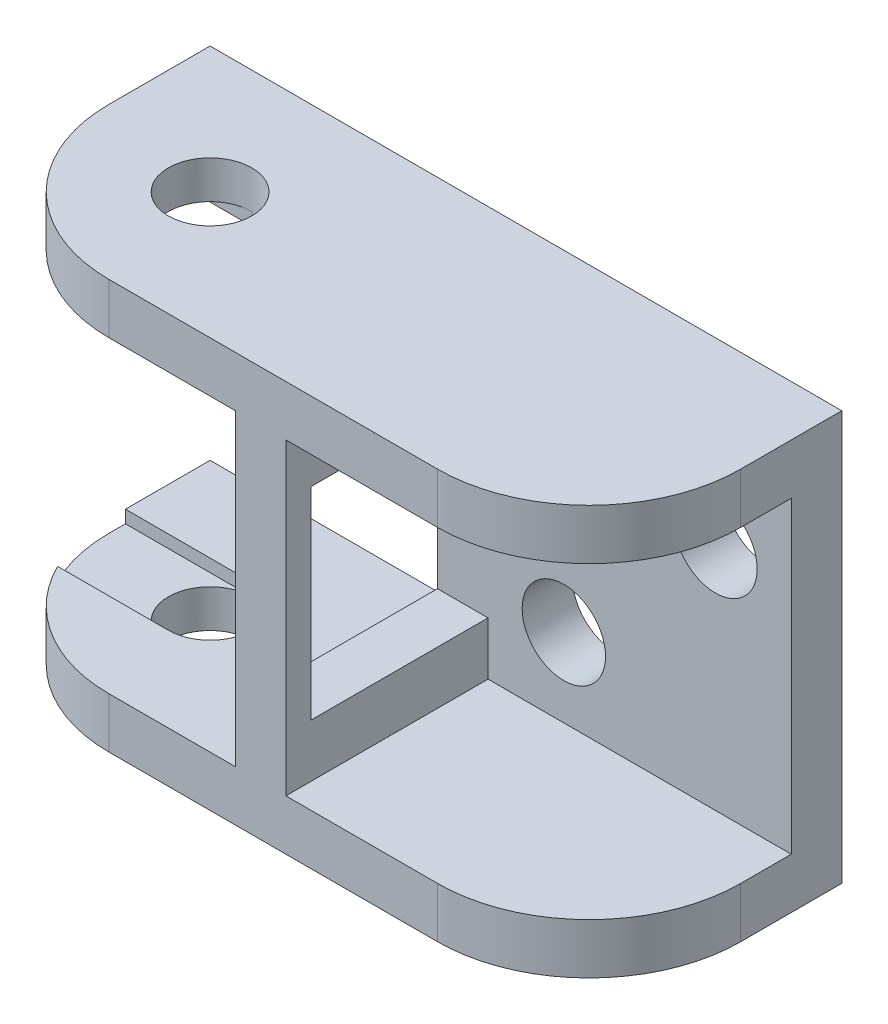
ISO-10303-21;
HEADER;
FILE_DESCRIPTION(('STEP AP214'),'2;1');
FILE_NAME('part.step','',(''),(''),'','','');
FILE_SCHEMA(('AUTOMOTIVE_DESIGN { 1 0 10303 214 1 1 1 1 }'));
ENDSEC;
DATA;
#1=APPLICATION_CONTEXT('core data for automotive mechanical design processes');
#2=APPLICATION_PROTOCOL_DEFINITION('international standard','automotive_design',2000,#1);
#3=PRODUCT_CONTEXT('',#1,'mechanical');
#4=PRODUCT('Part','Part','',(#3));
#5=PRODUCT_RELATED_PRODUCT_CATEGORY('part','',(#4));
#6=PRODUCT_DEFINITION_FORMATION('','',#4);
#7=PRODUCT_DEFINITION_CONTEXT('part definition',#1,'design');
#8=PRODUCT_DEFINITION('design','',#6,#7);
#9=PRODUCT_DEFINITION_SHAPE('','',#8);
#10=(LENGTH_UNIT() NAMED_UNIT(*) SI_UNIT(.MILLI.,.METRE.));
#11=(NAMED_UNIT(*) PLANE_ANGLE_UNIT() SI_UNIT($,.RADIAN.));
#12=(NAMED_UNIT(*) SI_UNIT($,.STERADIAN.) SOLID_ANGLE_UNIT());
#13=UNCERTAINTY_MEASURE_WITH_UNIT(LENGTH_MEASURE(1.E-05),#10,'distance_accuracy_value','');
#14=(GEOMETRIC_REPRESENTATION_CONTEXT(3) GLOBAL_UNCERTAINTY_ASSIGNED_CONTEXT((#13)) GLOBAL_UNIT_ASSIGNED_CONTEXT((#10,
#11,#12)) REPRESENTATION_CONTEXT('',''));
#15=CARTESIAN_POINT('',(0.,0.,0.));
#16=DIRECTION('',(0.,0.,1.));
#17=DIRECTION('',(1.,0.,0.));
#18=AXIS2_PLACEMENT_3D('',#15,#16,#17);
#19=CARTESIAN_POINT('',(5.,2.,5.));
#20=DIRECTION('',(0.,-1.,0.));
#21=DIRECTION('',(1.,0.,0.));
#22=AXIS2_PLACEMENT_3D('',#19,#20,#21);
#23=CYLINDRICAL_SURFACE('',#22,1.65);
#24=CARTESIAN_POINT('',(5.,2.,5.));
#25=DIRECTION('',(0.,-1.,0.));
#26=DIRECTION('',(1.,0.,0.));
#27=AXIS2_PLACEMENT_3D('',#24,#25,#26);
#28=CIRCLE('',#27,1.65);
#29=CARTESIAN_POINT('',(6.65,2.,5.));
#30=VERTEX_POINT('',#29);
#31=EDGE_CURVE('E467',#30,#30,#28,.T.);
#32=ORIENTED_EDGE('',*,*,#31,.F.);
#33=EDGE_LOOP('',(#32));
#34=FACE_BOUND('',#33,.T.);
#35=DIRECTION('',(0.,-1.,0.));
#36=VECTOR('',#35,1.);
#37=CARTESIAN_POINT('',(5.,0.5,3.35));
#38=LINE('',#37,#36);
#39=CARTESIAN_POINT('',(5.,0.5,3.35));
#40=VERTEX_POINT('',#39);
#41=CARTESIAN_POINT('',(5.,0.,3.35));
#42=VERTEX_POINT('',#41);
#43=EDGE_CURVE('E443',#40,#42,#38,.T.);
#44=ORIENTED_EDGE('',*,*,#43,.T.);
#45=CARTESIAN_POINT('',(5.,0.,5.));
#46=DIRECTION('',(0.,-1.,0.));
#47=DIRECTION('',(1.,0.,0.));
#48=AXIS2_PLACEMENT_3D('',#45,#46,#47);
#49=CIRCLE('',#48,1.65);
#50=CARTESIAN_POINT('',(5.,0.,6.65));
#51=VERTEX_POINT('',#50);
#52=EDGE_CURVE('E289',#42,#51,#49,.T.);
#53=ORIENTED_EDGE('',*,*,#52,.T.);
#54=DIRECTION('',(0.,-1.,0.));
#55=VECTOR('',#54,1.);
#56=CARTESIAN_POINT('',(5.,0.5,6.65));
#57=LINE('',#56,#55);
#58=CARTESIAN_POINT('',(5.,0.5,6.65));
#59=VERTEX_POINT('',#58);
#60=EDGE_CURVE('E438',#59,#51,#57,.T.);
#61=ORIENTED_EDGE('',*,*,#60,.F.);
#62=CARTESIAN_POINT('',(5.,0.5,5.));
#63=DIRECTION('',(0.,1.,0.));
#64=DIRECTION('',(-1.,0.,0.));
#65=AXIS2_PLACEMENT_3D('',#62,#63,#64);
#66=CIRCLE('',#65,1.65);
#67=EDGE_CURVE('E453',#59,#40,#66,.F.);
#68=ORIENTED_EDGE('',*,*,#67,.T.);
#69=EDGE_LOOP('',(#44,#53,#61,#68));
#70=FACE_BOUND('',#69,.T.);
#71=ADVANCED_FACE('F42',(#34,#70),#23,.F.);
#72=CARTESIAN_POINT('',(24.,-2.1,10.));
#73=DIRECTION('',(0.,1.,0.));
#74=DIRECTION('',(-1.,0.,0.));
#75=AXIS2_PLACEMENT_3D('',#72,#73,#74);
#76=PLANE('',#75);
#77=DIRECTION('',(-1.,0.,0.));
#78=VECTOR('',#77,1.);
#79=CARTESIAN_POINT('',(24.,-2.1,2.));
#80=LINE('',#79,#78);
#81=CARTESIAN_POINT('',(13.,-2.1,2.));
#82=VERTEX_POINT('',#81);
#83=CARTESIAN_POINT('',(11.,-2.1,2.));
#84=VERTEX_POINT('',#83);
#85=EDGE_CURVE('E290',#82,#84,#80,.T.);
#86=ORIENTED_EDGE('',*,*,#85,.F.);
#87=DIRECTION('',(0.,0.,1.));
#88=VECTOR('',#87,1.);
#89=CARTESIAN_POINT('',(13.,-2.1,10.));
#90=LINE('',#89,#88);
#91=CARTESIAN_POINT('',(13.,-2.1,9.));
#92=VERTEX_POINT('',#91);
#93=EDGE_CURVE('E331',#82,#92,#90,.T.);
#94=ORIENTED_EDGE('',*,*,#93,.T.);
#95=DIRECTION('',(1.,0.,0.));
#96=VECTOR('',#95,1.);
#97=CARTESIAN_POINT('',(11.,-2.1,9.));
#98=LINE('',#97,#96);
#99=CARTESIAN_POINT('',(11.,-2.1,9.));
#100=VERTEX_POINT('',#99);
#101=EDGE_CURVE('E461',#100,#92,#98,.T.);
#102=ORIENTED_EDGE('',*,*,#101,.F.);
#103=DIRECTION('',(0.,0.,-1.));
#104=VECTOR('',#103,1.);
#105=CARTESIAN_POINT('',(11.,-2.1,10.));
#106=LINE('',#105,#104);
#107=EDGE_CURVE('E506',#100,#84,#106,.T.);
#108=ORIENTED_EDGE('',*,*,#107,.T.);
#109=EDGE_LOOP('',(#86,#94,#102,#108));
#110=FACE_BOUND('',#109,.T.);
#111=ADVANCED_FACE('F588',(#110),#76,.F.);
#112=CARTESIAN_POINT('',(11.,0.,10.));
#113=DIRECTION('',(0.,1.,0.));
#114=DIRECTION('',(-1.,0.,0.));
#115=AXIS2_PLACEMENT_3D('',#112,#113,#114);
#116=PLANE('',#115);
#117=ORIENTED_EDGE('',*,*,#52,.F.);
#118=DIRECTION('',(1.,0.,0.));
#119=VECTOR('',#118,1.);
#120=CARTESIAN_POINT('',(-0.689599517111065,0.,3.35));
#121=LINE('',#120,#119);
#122=CARTESIAN_POINT('',(0.,0.,3.35));
#123=VERTEX_POINT('',#122);
#124=EDGE_CURVE('E435',#123,#42,#121,.T.);
#125=ORIENTED_EDGE('',*,*,#124,.F.);
#126=DIRECTION('',(0.,0.,-1.));
#127=VECTOR('',#126,1.);
#128=CARTESIAN_POINT('',(0.,0.,10.));
#129=LINE('',#128,#127);
#130=CARTESIAN_POINT('',(0.,0.,0.));
#131=VERTEX_POINT('',#130);
#132=EDGE_CURVE('E485',#123,#131,#129,.T.);
#133=ORIENTED_EDGE('',*,*,#132,.T.);
#134=DIRECTION('',(1.,0.,0.));
#135=VECTOR('',#134,1.);
#136=CARTESIAN_POINT('',(11.,0.,0.));
#137=LINE('',#136,#135);
#138=CARTESIAN_POINT('',(11.,0.,0.));
#139=VERTEX_POINT('',#138);
#140=EDGE_CURVE('E471',#131,#139,#137,.T.);
#141=ORIENTED_EDGE('',*,*,#140,.T.);
#142=DIRECTION('',(0.,0.,-1.));
#143=VECTOR('',#142,1.);
#144=CARTESIAN_POINT('',(11.,0.,10.));
#145=LINE('',#144,#143);
#146=CARTESIAN_POINT('',(11.,0.,10.));
#147=VERTEX_POINT('',#146);
#148=EDGE_CURVE('E510',#147,#139,#145,.T.);
#149=ORIENTED_EDGE('',*,*,#148,.F.);
#150=DIRECTION('',(1.,0.,0.));
#151=VECTOR('',#150,1.);
#152=CARTESIAN_POINT('',(11.,0.,10.));
#153=LINE('',#152,#151);
#154=CARTESIAN_POINT('',(6.,0.,10.));
#155=VERTEX_POINT('',#154);
#156=EDGE_CURVE('E475',#155,#147,#153,.T.);
#157=ORIENTED_EDGE('',*,*,#156,.F.);
#158=CARTESIAN_POINT('',(6.,0.,4.));
#159=DIRECTION('',(0.,1.,0.));
#160=DIRECTION('',(-1.,0.,0.));
#161=AXIS2_PLACEMENT_3D('',#158,#159,#160);
#162=CIRCLE('',#161,6.);
#163=CARTESIAN_POINT('',(0.616924670785296,0.,6.65));
#164=VERTEX_POINT('',#163);
#165=EDGE_CURVE('E518',#155,#164,#162,.F.);
#166=ORIENTED_EDGE('',*,*,#165,.T.);
#167=DIRECTION('',(-1.,0.,0.));
#168=VECTOR('',#167,1.);
#169=CARTESIAN_POINT('',(-0.689599517111065,0.,6.65));
#170=LINE('',#169,#168);
#171=EDGE_CURVE('E430',#51,#164,#170,.T.);
#172=ORIENTED_EDGE('',*,*,#171,.F.);
#173=EDGE_LOOP('',(#117,#125,#133,#141,#149,#157,#166,#172));
#174=FACE_BOUND('',#173,.T.);
#175=ADVANCED_FACE('F617',(#174),#116,.F.);
#176=CARTESIAN_POINT('',(11.,-2.1,10.));
#177=DIRECTION('',(1.,0.,0.));
#178=DIRECTION('',(0.,0.,-1.));
#179=AXIS2_PLACEMENT_3D('',#176,#177,#178);
#180=PLANE('',#179);
#181=DIRECTION('',(0.,-1.,0.));
#182=VECTOR('',#181,1.);
#183=CARTESIAN_POINT('',(11.,-2.1,0.));
#184=LINE('',#183,#182);
#185=CARTESIAN_POINT('',(11.,-12.2,0.));
#186=VERTEX_POINT('',#185);
#187=EDGE_CURVE('E489',#139,#186,#184,.T.);
#188=ORIENTED_EDGE('',*,*,#187,.T.);
#189=DIRECTION('',(0.,0.,-1.));
#190=VECTOR('',#189,1.);
#191=CARTESIAN_POINT('',(11.,-12.2,10.));
#192=LINE('',#191,#190);
#193=CARTESIAN_POINT('',(11.,-12.2,10.));
#194=VERTEX_POINT('',#193);
#195=EDGE_CURVE('E406',#194,#186,#192,.T.);
#196=ORIENTED_EDGE('',*,*,#195,.F.);
#197=DIRECTION('',(0.,-1.,0.));
#198=VECTOR('',#197,1.);
#199=CARTESIAN_POINT('',(11.,-2.1,10.));
#200=LINE('',#199,#198);
#201=EDGE_CURVE('E478',#147,#194,#200,.T.);
#202=ORIENTED_EDGE('',*,*,#201,.F.);
#203=ORIENTED_EDGE('',*,*,#148,.T.);
#204=EDGE_LOOP('',(#188,#196,#202,#203));
#205=FACE_BOUND('',#204,.T.);
#206=DIRECTION('',(0.,0.,-1.));
#207=VECTOR('',#206,1.);
#208=CARTESIAN_POINT('',(11.,-10.1,10.));
#209=LINE('',#208,#207);
#210=CARTESIAN_POINT('',(11.,-10.1,9.));
#211=VERTEX_POINT('',#210);
#212=CARTESIAN_POINT('',(11.,-10.1,2.));
#213=VERTEX_POINT('',#212);
#214=EDGE_CURVE('E255',#211,#213,#209,.T.);
#215=ORIENTED_EDGE('',*,*,#214,.T.);
#216=DIRECTION('',(0.,1.,0.));
#217=VECTOR('',#216,1.);
#218=CARTESIAN_POINT('',(11.,-2.1,2.));
#219=LINE('',#218,#217);
#220=EDGE_CURVE('E285',#213,#84,#219,.T.);
#221=ORIENTED_EDGE('',*,*,#220,.T.);
#222=ORIENTED_EDGE('',*,*,#107,.F.);
#223=DIRECTION('',(0.,1.,0.));
#224=VECTOR('',#223,1.);
#225=CARTESIAN_POINT('',(11.,-6.1,9.));
#226=LINE('',#225,#224);
#227=EDGE_CURVE('E293',#211,#100,#226,.T.);
#228=ORIENTED_EDGE('',*,*,#227,.F.);
#229=EDGE_LOOP('',(#215,#221,#222,#228));
#230=FACE_BOUND('',#229,.T.);
#231=ADVANCED_FACE('F592',(#205,#230),#180,.F.);
#232=CARTESIAN_POINT('',(25.,2.,10.));
#233=DIRECTION('',(-1.,0.,0.));
#234=DIRECTION('',(0.,0.,1.));
#235=AXIS2_PLACEMENT_3D('',#232,#233,#234);
#236=PLANE('',#235);
#237=DIRECTION('',(0.,0.,1.));
#238=VECTOR('',#237,1.);
#239=CARTESIAN_POINT('',(25.,-12.2,10.));
#240=LINE('',#239,#238);
#241=CARTESIAN_POINT('',(25.,-12.2,2.));
#242=VERTEX_POINT('',#241);
#243=CARTESIAN_POINT('',(25.,-12.2,4.));
#244=VERTEX_POINT('',#243);
#245=EDGE_CURVE('E241',#242,#244,#240,.T.);
#246=ORIENTED_EDGE('',*,*,#245,.T.);
#247=DIRECTION('',(0.,1.,0.));
#248=VECTOR('',#247,1.);
#249=CARTESIAN_POINT('',(25.,2.,4.));
#250=LINE('',#249,#248);
#251=CARTESIAN_POINT('',(25.,-14.2,4.));
#252=VERTEX_POINT('',#251);
#253=EDGE_CURVE('E234',#244,#252,#250,.F.);
#254=ORIENTED_EDGE('',*,*,#253,.T.);
#255=DIRECTION('',(0.,0.,-1.));
#256=VECTOR('',#255,1.);
#257=CARTESIAN_POINT('',(25.,-14.2,10.));
#258=LINE('',#257,#256);
#259=CARTESIAN_POINT('',(25.,-14.2,0.));
#260=VERTEX_POINT('',#259);
#261=EDGE_CURVE('E238',#252,#260,#258,.T.);
#262=ORIENTED_EDGE('',*,*,#261,.T.);
#263=DIRECTION('',(0.,1.,0.));
#264=VECTOR('',#263,1.);
#265=CARTESIAN_POINT('',(25.,0.,0.));
#266=LINE('',#265,#264);
#267=CARTESIAN_POINT('',(25.,2.,0.));
#268=VERTEX_POINT('',#267);
#269=EDGE_CURVE('E492',#260,#268,#266,.T.);
#270=ORIENTED_EDGE('',*,*,#269,.T.);
#271=DIRECTION('',(0.,0.,-1.));
#272=VECTOR('',#271,1.);
#273=CARTESIAN_POINT('',(25.,2.,10.));
#274=LINE('',#273,#272);
#275=CARTESIAN_POINT('',(25.,2.,4.));
#276=VERTEX_POINT('',#275);
#277=EDGE_CURVE('E505',#276,#268,#274,.T.);
#278=ORIENTED_EDGE('',*,*,#277,.F.);
#279=DIRECTION('',(0.,1.,0.));
#280=VECTOR('',#279,1.);
#281=CARTESIAN_POINT('',(25.,2.,4.));
#282=LINE('',#281,#280);
#283=CARTESIAN_POINT('',(25.,0.,4.));
#284=VERTEX_POINT('',#283);
#285=EDGE_CURVE('E62',#276,#284,#282,.F.);
#286=ORIENTED_EDGE('',*,*,#285,.T.);
#287=DIRECTION('',(0.,0.,-1.));
#288=VECTOR('',#287,1.);
#289=CARTESIAN_POINT('',(25.,0.,10.));
#290=LINE('',#289,#288);
#291=CARTESIAN_POINT('',(25.,0.,2.));
#292=VERTEX_POINT('',#291);
#293=EDGE_CURVE('E335',#284,#292,#290,.T.);
#294=ORIENTED_EDGE('',*,*,#293,.T.);
#295=DIRECTION('',(0.,1.,0.));
#296=VECTOR('',#295,1.);
#297=CARTESIAN_POINT('',(25.,-6.1,2.));
#298=LINE('',#297,#296);
#299=EDGE_CURVE('E304',#242,#292,#298,.T.);
#300=ORIENTED_EDGE('',*,*,#299,.F.);
#301=EDGE_LOOP('',(#246,#254,#262,#270,#278,#286,#294,#300));
#302=FACE_BOUND('',#301,.T.);
#303=ADVANCED_FACE('F236',(#302),#236,.F.);
#304=CARTESIAN_POINT('',(0.,2.,10.));
#305=DIRECTION('',(0.,-1.,0.));
#306=DIRECTION('',(1.,0.,0.));
#307=AXIS2_PLACEMENT_3D('',#304,#305,#306);
#308=PLANE('',#307);
#309=ORIENTED_EDGE('',*,*,#31,.T.);
#310=EDGE_LOOP('',(#309));
#311=FACE_BOUND('',#310,.T.);
#312=DIRECTION('',(-1.,0.,0.));
#313=VECTOR('',#312,1.);
#314=CARTESIAN_POINT('',(0.,2.,10.));
#315=LINE('',#314,#313);
#316=CARTESIAN_POINT('',(19.,2.,10.));
#317=VERTEX_POINT('',#316);
#318=CARTESIAN_POINT('',(6.,2.,10.));
#319=VERTEX_POINT('',#318);
#320=EDGE_CURVE('E482',#317,#319,#315,.T.);
#321=ORIENTED_EDGE('',*,*,#320,.F.);
#322=CARTESIAN_POINT('',(19.,2.,4.));
#323=DIRECTION('',(0.,-1.,0.));
#324=DIRECTION('',(1.,0.,0.));
#325=AXIS2_PLACEMENT_3D('',#322,#323,#324);
#326=CIRCLE('',#325,6.);
#327=EDGE_CURVE('E53',#317,#276,#326,.F.);
#328=ORIENTED_EDGE('',*,*,#327,.T.);
#329=ORIENTED_EDGE('',*,*,#277,.T.);
#330=DIRECTION('',(-1.,0.,0.));
#331=VECTOR('',#330,1.);
#332=CARTESIAN_POINT('',(0.,2.,0.));
#333=LINE('',#332,#331);
#334=CARTESIAN_POINT('',(0.,2.,0.));
#335=VERTEX_POINT('',#334);
#336=EDGE_CURVE('E493',#268,#335,#333,.T.);
#337=ORIENTED_EDGE('',*,*,#336,.T.);
#338=DIRECTION('',(0.,0.,-1.));
#339=VECTOR('',#338,1.);
#340=CARTESIAN_POINT('',(0.,2.,10.));
#341=LINE('',#340,#339);
#342=CARTESIAN_POINT('',(0.,2.,4.));
#343=VERTEX_POINT('',#342);
#344=EDGE_CURVE('E502',#343,#335,#341,.T.);
#345=ORIENTED_EDGE('',*,*,#344,.F.);
#346=CARTESIAN_POINT('',(6.,2.,4.));
#347=DIRECTION('',(0.,-1.,0.));
#348=DIRECTION('',(1.,0.,0.));
#349=AXIS2_PLACEMENT_3D('',#346,#347,#348);
#350=CIRCLE('',#349,6.);
#351=EDGE_CURVE('E525',#343,#319,#350,.F.);
#352=ORIENTED_EDGE('',*,*,#351,.T.);
#353=EDGE_LOOP('',(#321,#328,#329,#337,#345,#352));
#354=FACE_BOUND('',#353,.T.);
#355=ADVANCED_FACE('F630',(#311,#354),#308,.F.);
#356=CARTESIAN_POINT('',(0.,0.,10.));
#357=DIRECTION('',(1.,0.,0.));
#358=DIRECTION('',(0.,0.,-1.));
#359=AXIS2_PLACEMENT_3D('',#356,#357,#358);
#360=PLANE('',#359);
#361=ORIENTED_EDGE('',*,*,#132,.F.);
#362=DIRECTION('',(0.,1.,0.));
#363=VECTOR('',#362,1.);
#364=CARTESIAN_POINT('',(0.,0.,3.35));
#365=LINE('',#364,#363);
#366=CARTESIAN_POINT('',(0.,0.5,3.35));
#367=VERTEX_POINT('',#366);
#368=EDGE_CURVE('E457',#123,#367,#365,.T.);
#369=ORIENTED_EDGE('',*,*,#368,.T.);
#370=DIRECTION('',(0.,0.,1.));
#371=VECTOR('',#370,1.);
#372=CARTESIAN_POINT('',(0.,0.5,10.));
#373=LINE('',#372,#371);
#374=CARTESIAN_POINT('',(0.,0.5,4.));
#375=VERTEX_POINT('',#374);
#376=EDGE_CURVE('E447',#367,#375,#373,.T.);
#377=ORIENTED_EDGE('',*,*,#376,.T.);
#378=DIRECTION('',(0.,-1.,0.));
#379=VECTOR('',#378,1.);
#380=CARTESIAN_POINT('',(0.,0.,4.));
#381=LINE('',#380,#379);
#382=EDGE_CURVE('E522',#375,#343,#381,.F.);
#383=ORIENTED_EDGE('',*,*,#382,.T.);
#384=ORIENTED_EDGE('',*,*,#344,.T.);
#385=DIRECTION('',(0.,-1.,0.));
#386=VECTOR('',#385,1.);
#387=CARTESIAN_POINT('',(0.,0.,0.));
#388=LINE('',#387,#386);
#389=EDGE_CURVE('E479',#335,#131,#388,.T.);
#390=ORIENTED_EDGE('',*,*,#389,.T.);
#391=EDGE_LOOP('',(#361,#369,#377,#383,#384,#390));
#392=FACE_BOUND('',#391,.T.);
#393=ADVANCED_FACE('F624',(#392),#360,.F.);
#394=CARTESIAN_POINT('',(0.,0.,10.));
#395=DIRECTION('',(0.,0.,-1.));
#396=DIRECTION('',(-1.,0.,0.));
#397=AXIS2_PLACEMENT_3D('',#394,#395,#396);
#398=PLANE('',#397);
#399=DIRECTION('',(-1.,0.,0.));
#400=VECTOR('',#399,1.);
#401=CARTESIAN_POINT('',(0.,-14.2,10.));
#402=LINE('',#401,#400);
#403=CARTESIAN_POINT('',(19.,-14.2,10.));
#404=VERTEX_POINT('',#403);
#405=CARTESIAN_POINT('',(6.,-14.2,10.));
#406=VERTEX_POINT('',#405);
#407=EDGE_CURVE('E386',#404,#406,#402,.T.);
#408=ORIENTED_EDGE('',*,*,#407,.F.);
#409=DIRECTION('',(0.,1.,0.));
#410=VECTOR('',#409,1.);
#411=CARTESIAN_POINT('',(19.,0.,10.));
#412=LINE('',#411,#410);
#413=CARTESIAN_POINT('',(19.,-12.2,10.));
#414=VERTEX_POINT('',#413);
#415=EDGE_CURVE('E261',#404,#414,#412,.T.);
#416=ORIENTED_EDGE('',*,*,#415,.T.);
#417=DIRECTION('',(1.,0.,0.));
#418=VECTOR('',#417,1.);
#419=CARTESIAN_POINT('',(29.7709195529096,-12.2,10.));
#420=LINE('',#419,#418);
#421=CARTESIAN_POINT('',(13.,-12.2,10.));
#422=VERTEX_POINT('',#421);
#423=EDGE_CURVE('E308',#422,#414,#420,.T.);
#424=ORIENTED_EDGE('',*,*,#423,.F.);
#425=DIRECTION('',(0.,-1.,0.));
#426=VECTOR('',#425,1.);
#427=CARTESIAN_POINT('',(13.,-12.2,10.));
#428=LINE('',#427,#426);
#429=CARTESIAN_POINT('',(13.,0.,10.));
#430=VERTEX_POINT('',#429);
#431=EDGE_CURVE('E312',#430,#422,#428,.T.);
#432=ORIENTED_EDGE('',*,*,#431,.F.);
#433=DIRECTION('',(1.,0.,0.));
#434=VECTOR('',#433,1.);
#435=CARTESIAN_POINT('',(0.,0.,10.));
#436=LINE('',#435,#434);
#437=CARTESIAN_POINT('',(19.,0.,10.));
#438=VERTEX_POINT('',#437);
#439=EDGE_CURVE('E106',#430,#438,#436,.T.);
#440=ORIENTED_EDGE('',*,*,#439,.T.);
#441=DIRECTION('',(0.,1.,0.));
#442=VECTOR('',#441,1.);
#443=CARTESIAN_POINT('',(19.,0.,10.));
#444=LINE('',#443,#442);
#445=EDGE_CURVE('E545',#438,#317,#444,.T.);
#446=ORIENTED_EDGE('',*,*,#445,.T.);
#447=ORIENTED_EDGE('',*,*,#320,.T.);
#448=DIRECTION('',(0.,-1.,0.));
#449=VECTOR('',#448,1.);
#450=CARTESIAN_POINT('',(6.,0.,10.));
#451=LINE('',#450,#449);
#452=EDGE_CURVE('E514',#319,#155,#451,.T.);
#453=ORIENTED_EDGE('',*,*,#452,.T.);
#454=ORIENTED_EDGE('',*,*,#156,.T.);
#455=ORIENTED_EDGE('',*,*,#201,.T.);
#456=DIRECTION('',(1.,0.,0.));
#457=VECTOR('',#456,1.);
#458=CARTESIAN_POINT('',(11.,-12.2,10.));
#459=LINE('',#458,#457);
#460=CARTESIAN_POINT('',(6.,-12.2,10.));
#461=VERTEX_POINT('',#460);
#462=EDGE_CURVE('E382',#461,#194,#459,.T.);
#463=ORIENTED_EDGE('',*,*,#462,.F.);
#464=DIRECTION('',(0.,1.,0.));
#465=VECTOR('',#464,1.);
#466=CARTESIAN_POINT('',(6.,-12.2,10.));
#467=LINE('',#466,#465);
#468=EDGE_CURVE('E410',#406,#461,#467,.T.);
#469=ORIENTED_EDGE('',*,*,#468,.F.);
#470=EDGE_LOOP('',(#408,#416,#424,#432,#440,#446,#447,#453,#454,#455,#463,#469));
#471=FACE_BOUND('',#470,.T.);
#472=ADVANCED_FACE('F556',(#471),#398,.F.);
#473=CARTESIAN_POINT('',(0.,0.,0.));
#474=DIRECTION('',(0.,0.,-1.));
#475=DIRECTION('',(-1.,0.,0.));
#476=AXIS2_PLACEMENT_3D('',#473,#474,#475);
#477=PLANE('',#476);
#478=CARTESIAN_POINT('',(16.,-9.1,0.));
#479=DIRECTION('',(0.,0.,1.));
#480=DIRECTION('',(1.,0.,0.));
#481=AXIS2_PLACEMENT_3D('',#478,#479,#480);
#482=CIRCLE('',#481,1.65);
#483=CARTESIAN_POINT('',(17.65,-9.1,0.));
#484=VERTEX_POINT('',#483);
#485=EDGE_CURVE('E274',#484,#484,#482,.T.);
#486=ORIENTED_EDGE('',*,*,#485,.T.);
#487=EDGE_LOOP('',(#486));
#488=FACE_BOUND('',#487,.T.);
#489=CARTESIAN_POINT('',(22.,-3.1,0.));
#490=DIRECTION('',(0.,0.,1.));
#491=DIRECTION('',(1.,0.,0.));
#492=AXIS2_PLACEMENT_3D('',#489,#490,#491);
#493=CIRCLE('',#492,1.65);
#494=CARTESIAN_POINT('',(23.65,-3.1,0.));
#495=VERTEX_POINT('',#494);
#496=EDGE_CURVE('E275',#495,#495,#493,.T.);
#497=ORIENTED_EDGE('',*,*,#496,.T.);
#498=EDGE_LOOP('',(#497));
#499=FACE_BOUND('',#498,.T.);
#500=ORIENTED_EDGE('',*,*,#269,.F.);
#501=DIRECTION('',(-1.,0.,0.));
#502=VECTOR('',#501,1.);
#503=CARTESIAN_POINT('',(0.,-14.2,0.));
#504=LINE('',#503,#502);
#505=CARTESIAN_POINT('',(0.,-14.2,0.));
#506=VERTEX_POINT('',#505);
#507=EDGE_CURVE('E253',#260,#506,#504,.T.);
#508=ORIENTED_EDGE('',*,*,#507,.T.);
#509=DIRECTION('',(0.,1.,0.));
#510=VECTOR('',#509,1.);
#511=CARTESIAN_POINT('',(0.,-12.2,0.));
#512=LINE('',#511,#510);
#513=CARTESIAN_POINT('',(0.,-12.2,0.));
#514=VERTEX_POINT('',#513);
#515=EDGE_CURVE('E387',#506,#514,#512,.T.);
#516=ORIENTED_EDGE('',*,*,#515,.T.);
#517=DIRECTION('',(1.,0.,0.));
#518=VECTOR('',#517,1.);
#519=CARTESIAN_POINT('',(11.,-12.2,0.));
#520=LINE('',#519,#518);
#521=EDGE_CURVE('E378',#514,#186,#520,.T.);
#522=ORIENTED_EDGE('',*,*,#521,.T.);
#523=ORIENTED_EDGE('',*,*,#187,.F.);
#524=ORIENTED_EDGE('',*,*,#140,.F.);
#525=ORIENTED_EDGE('',*,*,#389,.F.);
#526=ORIENTED_EDGE('',*,*,#336,.F.);
#527=EDGE_LOOP('',(#500,#508,#516,#522,#523,#524,#525,#526));
#528=FACE_BOUND('',#527,.T.);
#529=ADVANCED_FACE('F570',(#488,#499,#528),#477,.T.);
#530=CARTESIAN_POINT('',(6.,0.,4.));
#531=DIRECTION('',(0.,-1.,0.));
#532=DIRECTION('',(0.,0.,-1.));
#533=AXIS2_PLACEMENT_3D('',#530,#531,#532);
#534=CYLINDRICAL_SURFACE('',#533,6.);
#535=DIRECTION('',(0.,-1.,0.));
#536=VECTOR('',#535,1.);
#537=CARTESIAN_POINT('',(0.616924670785296,0.,6.65));
#538=LINE('',#537,#536);
#539=CARTESIAN_POINT('',(0.616924670785296,0.5,6.65));
#540=VERTEX_POINT('',#539);
#541=EDGE_CURVE('E532',#164,#540,#538,.F.);
#542=ORIENTED_EDGE('',*,*,#541,.F.);
#543=ORIENTED_EDGE('',*,*,#165,.F.);
#544=ORIENTED_EDGE('',*,*,#452,.F.);
#545=ORIENTED_EDGE('',*,*,#351,.F.);
#546=ORIENTED_EDGE('',*,*,#382,.F.);
#547=CARTESIAN_POINT('',(6.,0.5,4.));
#548=DIRECTION('',(0.,1.,0.));
#549=DIRECTION('',(-1.,0.,0.));
#550=AXIS2_PLACEMENT_3D('',#547,#548,#549);
#551=CIRCLE('',#550,6.);
#552=EDGE_CURVE('E529',#540,#375,#551,.F.);
#553=ORIENTED_EDGE('',*,*,#552,.F.);
#554=EDGE_LOOP('',(#542,#543,#544,#545,#546,#553));
#555=FACE_BOUND('',#554,.T.);
#556=ADVANCED_FACE('F609',(#555),#534,.T.);
#557=CARTESIAN_POINT('',(11.,-6.1,2.));
#558=DIRECTION('',(0.,0.,-1.));
#559=DIRECTION('',(-1.,0.,0.));
#560=AXIS2_PLACEMENT_3D('',#557,#558,#559);
#561=PLANE('',#560);
#562=CARTESIAN_POINT('',(16.,-9.1,2.));
#563=DIRECTION('',(0.,0.,-1.));
#564=DIRECTION('',(-1.,0.,0.));
#565=AXIS2_PLACEMENT_3D('',#562,#563,#564);
#566=CIRCLE('',#565,1.65);
#567=CARTESIAN_POINT('',(14.35,-9.1,2.));
#568=VERTEX_POINT('',#567);
#569=EDGE_CURVE('E270',#568,#568,#566,.F.);
#570=ORIENTED_EDGE('',*,*,#569,.F.);
#571=EDGE_LOOP('',(#570));
#572=FACE_BOUND('',#571,.T.);
#573=CARTESIAN_POINT('',(22.,-3.1,2.));
#574=DIRECTION('',(0.,0.,-1.));
#575=DIRECTION('',(-1.,0.,0.));
#576=AXIS2_PLACEMENT_3D('',#573,#574,#575);
#577=CIRCLE('',#576,1.65);
#578=CARTESIAN_POINT('',(20.35,-3.1,2.));
#579=VERTEX_POINT('',#578);
#580=EDGE_CURVE('E276',#579,#579,#577,.F.);
#581=ORIENTED_EDGE('',*,*,#580,.F.);
#582=EDGE_LOOP('',(#581));
#583=FACE_BOUND('',#582,.T.);
#584=DIRECTION('',(-1.,0.,0.));
#585=VECTOR('',#584,1.);
#586=CARTESIAN_POINT('',(11.,-10.1,2.));
#587=LINE('',#586,#585);
#588=CARTESIAN_POINT('',(13.,-10.1,2.));
#589=VERTEX_POINT('',#588);
#590=EDGE_CURVE('E280',#589,#213,#587,.T.);
#591=ORIENTED_EDGE('',*,*,#590,.F.);
#592=DIRECTION('',(0.,-1.,0.));
#593=VECTOR('',#592,1.);
#594=CARTESIAN_POINT('',(13.,-12.2,2.));
#595=LINE('',#594,#593);
#596=CARTESIAN_POINT('',(13.,-12.2,2.));
#597=VERTEX_POINT('',#596);
#598=EDGE_CURVE('E46',#589,#597,#595,.T.);
#599=ORIENTED_EDGE('',*,*,#598,.T.);
#600=DIRECTION('',(1.,0.,0.));
#601=VECTOR('',#600,1.);
#602=CARTESIAN_POINT('',(29.7709195529096,-12.2,2.00000000000001));
#603=LINE('',#602,#601);
#604=EDGE_CURVE('E303',#597,#242,#603,.T.);
#605=ORIENTED_EDGE('',*,*,#604,.T.);
#606=ORIENTED_EDGE('',*,*,#299,.T.);
#607=DIRECTION('',(-1.,0.,0.));
#608=VECTOR('',#607,1.);
#609=CARTESIAN_POINT('',(29.7709195529096,0.,2.00000000000001));
#610=LINE('',#609,#608);
#611=CARTESIAN_POINT('',(13.,0.,2.));
#612=VERTEX_POINT('',#611);
#613=EDGE_CURVE('E299',#292,#612,#610,.T.);
#614=ORIENTED_EDGE('',*,*,#613,.T.);
#615=DIRECTION('',(0.,-1.,0.));
#616=VECTOR('',#615,1.);
#617=CARTESIAN_POINT('',(13.,-12.2,2.));
#618=LINE('',#617,#616);
#619=EDGE_CURVE('E294',#612,#82,#618,.T.);
#620=ORIENTED_EDGE('',*,*,#619,.T.);
#621=ORIENTED_EDGE('',*,*,#85,.T.);
#622=ORIENTED_EDGE('',*,*,#220,.F.);
#623=EDGE_LOOP('',(#591,#599,#605,#606,#614,#620,#621,#622));
#624=FACE_BOUND('',#623,.T.);
#625=ADVANCED_FACE('F44',(#572,#583,#624),#561,.F.);
#626=CARTESIAN_POINT('',(11.,-6.1,9.));
#627=DIRECTION('',(0.,0.,1.));
#628=DIRECTION('',(1.,0.,0.));
#629=AXIS2_PLACEMENT_3D('',#626,#627,#628);
#630=PLANE('',#629);
#631=ORIENTED_EDGE('',*,*,#101,.T.);
#632=DIRECTION('',(0.,-1.,0.));
#633=VECTOR('',#632,1.);
#634=CARTESIAN_POINT('',(13.,-6.1,9.));
#635=LINE('',#634,#633);
#636=CARTESIAN_POINT('',(13.,-10.1,9.));
#637=VERTEX_POINT('',#636);
#638=EDGE_CURVE('E327',#92,#637,#635,.T.);
#639=ORIENTED_EDGE('',*,*,#638,.T.);
#640=DIRECTION('',(1.,0.,0.));
#641=VECTOR('',#640,1.);
#642=CARTESIAN_POINT('',(11.,-10.1,9.));
#643=LINE('',#642,#641);
#644=EDGE_CURVE('E284',#211,#637,#643,.T.);
#645=ORIENTED_EDGE('',*,*,#644,.F.);
#646=ORIENTED_EDGE('',*,*,#227,.T.);
#647=EDGE_LOOP('',(#631,#639,#645,#646));
#648=FACE_BOUND('',#647,.T.);
#649=ADVANCED_FACE('F598',(#648),#630,.F.);
#650=CARTESIAN_POINT('',(-0.689599517111065,0.5,3.35));
#651=DIRECTION('',(0.,0.,-1.));
#652=DIRECTION('',(-1.,0.,0.));
#653=AXIS2_PLACEMENT_3D('',#650,#651,#652);
#654=PLANE('',#653);
#655=ORIENTED_EDGE('',*,*,#124,.T.);
#656=ORIENTED_EDGE('',*,*,#43,.F.);
#657=DIRECTION('',(1.,0.,0.));
#658=VECTOR('',#657,1.);
#659=CARTESIAN_POINT('',(-0.689599517111065,0.5,3.35));
#660=LINE('',#659,#658);
#661=EDGE_CURVE('E434',#367,#40,#660,.T.);
#662=ORIENTED_EDGE('',*,*,#661,.F.);
#663=ORIENTED_EDGE('',*,*,#368,.F.);
#664=EDGE_LOOP('',(#655,#656,#662,#663));
#665=FACE_BOUND('',#664,.T.);
#666=ADVANCED_FACE('F600',(#665),#654,.F.);
#667=CARTESIAN_POINT('',(0.,0.5,0.));
#668=DIRECTION('',(0.,1.,0.));
#669=DIRECTION('',(-1.,0.,0.));
#670=AXIS2_PLACEMENT_3D('',#667,#668,#669);
#671=PLANE('',#670);
#672=DIRECTION('',(-1.,0.,0.));
#673=VECTOR('',#672,1.);
#674=CARTESIAN_POINT('',(-0.689599517111065,0.5,6.65));
#675=LINE('',#674,#673);
#676=EDGE_CURVE('E431',#59,#540,#675,.T.);
#677=ORIENTED_EDGE('',*,*,#676,.T.);
#678=ORIENTED_EDGE('',*,*,#552,.T.);
#679=ORIENTED_EDGE('',*,*,#376,.F.);
#680=ORIENTED_EDGE('',*,*,#661,.T.);
#681=ORIENTED_EDGE('',*,*,#67,.F.);
#682=EDGE_LOOP('',(#677,#678,#679,#680,#681));
#683=FACE_BOUND('',#682,.T.);
#684=ADVANCED_FACE('F605',(#683),#671,.F.);
#685=CARTESIAN_POINT('',(-0.689599517111065,0.5,6.65));
#686=DIRECTION('',(0.,0.,1.));
#687=DIRECTION('',(1.,0.,0.));
#688=AXIS2_PLACEMENT_3D('',#685,#686,#687);
#689=PLANE('',#688);
#690=ORIENTED_EDGE('',*,*,#541,.T.);
#691=ORIENTED_EDGE('',*,*,#676,.F.);
#692=ORIENTED_EDGE('',*,*,#60,.T.);
#693=ORIENTED_EDGE('',*,*,#171,.T.);
#694=EDGE_LOOP('',(#690,#691,#692,#693));
#695=FACE_BOUND('',#694,.T.);
#696=ADVANCED_FACE('F766',(#695),#689,.F.);
#697=CARTESIAN_POINT('',(5.,-14.2,5.));
#698=DIRECTION('',(0.,1.,0.));
#699=DIRECTION('',(1.,0.,0.));
#700=AXIS2_PLACEMENT_3D('',#697,#698,#699);
#701=CYLINDRICAL_SURFACE('',#700,1.65);
#702=CARTESIAN_POINT('',(5.,-14.2,5.));
#703=DIRECTION('',(0.,-1.,0.));
#704=DIRECTION('',(1.,0.,0.));
#705=AXIS2_PLACEMENT_3D('',#702,#703,#704);
#706=CIRCLE('',#705,1.65);
#707=CARTESIAN_POINT('',(6.65,-14.2,5.));
#708=VERTEX_POINT('',#707);
#709=EDGE_CURVE('E374',#708,#708,#706,.T.);
#710=ORIENTED_EDGE('',*,*,#709,.T.);
#711=EDGE_LOOP('',(#710));
#712=FACE_BOUND('',#711,.T.);
#713=DIRECTION('',(0.,1.,0.));
#714=VECTOR('',#713,1.);
#715=CARTESIAN_POINT('',(5.,-12.7,3.35));
#716=LINE('',#715,#714);
#717=CARTESIAN_POINT('',(5.,-12.7,3.35));
#718=VERTEX_POINT('',#717);
#719=CARTESIAN_POINT('',(5.,-12.2,3.35));
#720=VERTEX_POINT('',#719);
#721=EDGE_CURVE('E352',#718,#720,#716,.T.);
#722=ORIENTED_EDGE('',*,*,#721,.F.);
#723=CARTESIAN_POINT('',(5.,-12.7,5.));
#724=DIRECTION('',(0.,1.,0.));
#725=DIRECTION('',(-1.,0.,0.));
#726=AXIS2_PLACEMENT_3D('',#723,#724,#725);
#727=CIRCLE('',#726,1.65);
#728=CARTESIAN_POINT('',(5.,-12.7,6.65));
#729=VERTEX_POINT('',#728);
#730=EDGE_CURVE('E363',#729,#718,#727,.F.);
#731=ORIENTED_EDGE('',*,*,#730,.F.);
#732=DIRECTION('',(0.,1.,0.));
#733=VECTOR('',#732,1.);
#734=CARTESIAN_POINT('',(5.,-12.7,6.65));
#735=LINE('',#734,#733);
#736=CARTESIAN_POINT('',(5.,-12.2,6.65));
#737=VERTEX_POINT('',#736);
#738=EDGE_CURVE('E346',#729,#737,#735,.T.);
#739=ORIENTED_EDGE('',*,*,#738,.T.);
#740=CARTESIAN_POINT('',(5.,-12.2,5.));
#741=DIRECTION('',(0.,-1.,0.));
#742=DIRECTION('',(1.,0.,0.));
#743=AXIS2_PLACEMENT_3D('',#740,#741,#742);
#744=CIRCLE('',#743,1.65);
#745=EDGE_CURVE('E283',#720,#737,#744,.T.);
#746=ORIENTED_EDGE('',*,*,#745,.F.);
#747=EDGE_LOOP('',(#722,#731,#739,#746));
#748=FACE_BOUND('',#747,.T.);
#749=ADVANCED_FACE('F757',(#712,#748),#701,.F.);
#750=CARTESIAN_POINT('',(24.,-10.1,10.));
#751=DIRECTION('',(0.,-1.,0.));
#752=DIRECTION('',(-1.,0.,0.));
#753=AXIS2_PLACEMENT_3D('',#750,#751,#752);
#754=PLANE('',#753);
#755=ORIENTED_EDGE('',*,*,#644,.T.);
#756=DIRECTION('',(0.,0.,-1.));
#757=VECTOR('',#756,1.);
#758=CARTESIAN_POINT('',(13.,-10.1,10.));
#759=LINE('',#758,#757);
#760=EDGE_CURVE('E535',#637,#589,#759,.T.);
#761=ORIENTED_EDGE('',*,*,#760,.T.);
#762=ORIENTED_EDGE('',*,*,#590,.T.);
#763=ORIENTED_EDGE('',*,*,#214,.F.);
#764=EDGE_LOOP('',(#755,#761,#762,#763));
#765=FACE_BOUND('',#764,.T.);
#766=ADVANCED_FACE('F595',(#765),#754,.F.);
#767=CARTESIAN_POINT('',(11.,-12.2,10.));
#768=DIRECTION('',(0.,-1.,0.));
#769=DIRECTION('',(-1.,0.,0.));
#770=AXIS2_PLACEMENT_3D('',#767,#768,#769);
#771=PLANE('',#770);
#772=ORIENTED_EDGE('',*,*,#745,.T.);
#773=DIRECTION('',(-1.,0.,0.));
#774=VECTOR('',#773,1.);
#775=CARTESIAN_POINT('',(-0.689599517111064,-12.2,6.65));
#776=LINE('',#775,#774);
#777=CARTESIAN_POINT('',(0.616924670785297,-12.2,6.65));
#778=VERTEX_POINT('',#777);
#779=EDGE_CURVE('E307',#737,#778,#776,.T.);
#780=ORIENTED_EDGE('',*,*,#779,.T.);
#781=CARTESIAN_POINT('',(6.,-12.2,4.));
#782=DIRECTION('',(0.,1.,0.));
#783=DIRECTION('',(-1.,0.,0.));
#784=AXIS2_PLACEMENT_3D('',#781,#782,#783);
#785=CIRCLE('',#784,6.);
#786=EDGE_CURVE('E413',#461,#778,#785,.F.);
#787=ORIENTED_EDGE('',*,*,#786,.F.);
#788=ORIENTED_EDGE('',*,*,#462,.T.);
#789=ORIENTED_EDGE('',*,*,#195,.T.);
#790=ORIENTED_EDGE('',*,*,#521,.F.);
#791=DIRECTION('',(0.,0.,-1.));
#792=VECTOR('',#791,1.);
#793=CARTESIAN_POINT('',(0.,-12.2,10.));
#794=LINE('',#793,#792);
#795=CARTESIAN_POINT('',(0.,-12.2,3.35));
#796=VERTEX_POINT('',#795);
#797=EDGE_CURVE('E390',#796,#514,#794,.T.);
#798=ORIENTED_EDGE('',*,*,#797,.F.);
#799=DIRECTION('',(1.,0.,0.));
#800=VECTOR('',#799,1.);
#801=CARTESIAN_POINT('',(-0.689599517111064,-12.2,3.35));
#802=LINE('',#801,#800);
#803=EDGE_CURVE('E343',#796,#720,#802,.T.);
#804=ORIENTED_EDGE('',*,*,#803,.T.);
#805=EDGE_LOOP('',(#772,#780,#787,#788,#789,#790,#798,#804));
#806=FACE_BOUND('',#805,.T.);
#807=ADVANCED_FACE('F737',(#806),#771,.F.);
#808=CARTESIAN_POINT('',(0.,-14.2,10.));
#809=DIRECTION('',(0.,1.,0.));
#810=DIRECTION('',(1.,0.,0.));
#811=AXIS2_PLACEMENT_3D('',#808,#809,#810);
#812=PLANE('',#811);
#813=ORIENTED_EDGE('',*,*,#709,.F.);
#814=EDGE_LOOP('',(#813));
#815=FACE_BOUND('',#814,.T.);
#816=ORIENTED_EDGE('',*,*,#261,.F.);
#817=CARTESIAN_POINT('',(19.,-14.2,4.));
#818=DIRECTION('',(0.,1.,0.));
#819=DIRECTION('',(-1.,0.,0.));
#820=AXIS2_PLACEMENT_3D('',#817,#818,#819);
#821=CIRCLE('',#820,6.);
#822=EDGE_CURVE('E245',#252,#404,#821,.F.);
#823=ORIENTED_EDGE('',*,*,#822,.T.);
#824=ORIENTED_EDGE('',*,*,#407,.T.);
#825=CARTESIAN_POINT('',(6.,-14.2,4.));
#826=DIRECTION('',(0.,-1.,0.));
#827=DIRECTION('',(1.,0.,0.));
#828=AXIS2_PLACEMENT_3D('',#825,#826,#827);
#829=CIRCLE('',#828,6.);
#830=CARTESIAN_POINT('',(0.,-14.2,4.));
#831=VERTEX_POINT('',#830);
#832=EDGE_CURVE('E420',#831,#406,#829,.F.);
#833=ORIENTED_EDGE('',*,*,#832,.F.);
#834=DIRECTION('',(0.,0.,-1.));
#835=VECTOR('',#834,1.);
#836=CARTESIAN_POINT('',(0.,-14.2,10.));
#837=LINE('',#836,#835);
#838=EDGE_CURVE('E256',#831,#506,#837,.T.);
#839=ORIENTED_EDGE('',*,*,#838,.T.);
#840=ORIENTED_EDGE('',*,*,#507,.F.);
#841=EDGE_LOOP('',(#816,#823,#824,#833,#839,#840));
#842=FACE_BOUND('',#841,.T.);
#843=ADVANCED_FACE('F249',(#815,#842),#812,.F.);
#844=CARTESIAN_POINT('',(0.,-12.2,10.));
#845=DIRECTION('',(1.,0.,0.));
#846=DIRECTION('',(0.,0.,-1.));
#847=AXIS2_PLACEMENT_3D('',#844,#845,#846);
#848=PLANE('',#847);
#849=ORIENTED_EDGE('',*,*,#797,.T.);
#850=ORIENTED_EDGE('',*,*,#515,.F.);
#851=ORIENTED_EDGE('',*,*,#838,.F.);
#852=DIRECTION('',(0.,1.,0.));
#853=VECTOR('',#852,1.);
#854=CARTESIAN_POINT('',(0.,-12.2,4.));
#855=LINE('',#854,#853);
#856=CARTESIAN_POINT('',(0.,-12.7,4.));
#857=VERTEX_POINT('',#856);
#858=EDGE_CURVE('E417',#857,#831,#855,.F.);
#859=ORIENTED_EDGE('',*,*,#858,.F.);
#860=DIRECTION('',(0.,0.,1.));
#861=VECTOR('',#860,1.);
#862=CARTESIAN_POINT('',(0.,-12.7,10.));
#863=LINE('',#862,#861);
#864=CARTESIAN_POINT('',(0.,-12.7,3.35));
#865=VERTEX_POINT('',#864);
#866=EDGE_CURVE('E356',#865,#857,#863,.T.);
#867=ORIENTED_EDGE('',*,*,#866,.F.);
#868=DIRECTION('',(0.,-1.,0.));
#869=VECTOR('',#868,1.);
#870=CARTESIAN_POINT('',(0.,-12.2,3.35));
#871=LINE('',#870,#869);
#872=EDGE_CURVE('E367',#796,#865,#871,.T.);
#873=ORIENTED_EDGE('',*,*,#872,.F.);
#874=EDGE_LOOP('',(#849,#850,#851,#859,#867,#873));
#875=FACE_BOUND('',#874,.T.);
#876=ADVANCED_FACE('F565',(#875),#848,.F.);
#877=CARTESIAN_POINT('',(6.,-12.2,4.));
#878=DIRECTION('',(0.,1.,0.));
#879=DIRECTION('',(0.,0.,-1.));
#880=AXIS2_PLACEMENT_3D('',#877,#878,#879);
#881=CYLINDRICAL_SURFACE('',#880,6.);
#882=DIRECTION('',(0.,1.,0.));
#883=VECTOR('',#882,1.);
#884=CARTESIAN_POINT('',(0.616924670785297,-12.2,6.65));
#885=LINE('',#884,#883);
#886=CARTESIAN_POINT('',(0.616924670785297,-12.7,6.65));
#887=VERTEX_POINT('',#886);
#888=EDGE_CURVE('E426',#778,#887,#885,.F.);
#889=ORIENTED_EDGE('',*,*,#888,.T.);
#890=CARTESIAN_POINT('',(6.,-12.7,4.));
#891=DIRECTION('',(0.,1.,0.));
#892=DIRECTION('',(-1.,0.,0.));
#893=AXIS2_PLACEMENT_3D('',#890,#891,#892);
#894=CIRCLE('',#893,6.);
#895=EDGE_CURVE('E423',#887,#857,#894,.F.);
#896=ORIENTED_EDGE('',*,*,#895,.T.);
#897=ORIENTED_EDGE('',*,*,#858,.T.);
#898=ORIENTED_EDGE('',*,*,#832,.T.);
#899=ORIENTED_EDGE('',*,*,#468,.T.);
#900=ORIENTED_EDGE('',*,*,#786,.T.);
#901=EDGE_LOOP('',(#889,#896,#897,#898,#899,#900));
#902=FACE_BOUND('',#901,.T.);
#903=ADVANCED_FACE('F712',(#902),#881,.T.);
#904=CARTESIAN_POINT('',(-0.689599517111064,-12.7,3.35));
#905=DIRECTION('',(0.,0.,-1.));
#906=DIRECTION('',(-1.,0.,0.));
#907=AXIS2_PLACEMENT_3D('',#904,#905,#906);
#908=PLANE('',#907);
#909=ORIENTED_EDGE('',*,*,#803,.F.);
#910=ORIENTED_EDGE('',*,*,#872,.T.);
#911=DIRECTION('',(1.,0.,0.));
#912=VECTOR('',#911,1.);
#913=CARTESIAN_POINT('',(-0.689599517111064,-12.7,3.35));
#914=LINE('',#913,#912);
#915=EDGE_CURVE('E342',#865,#718,#914,.T.);
#916=ORIENTED_EDGE('',*,*,#915,.T.);
#917=ORIENTED_EDGE('',*,*,#721,.T.);
#918=EDGE_LOOP('',(#909,#910,#916,#917));
#919=FACE_BOUND('',#918,.T.);
#920=ADVANCED_FACE('F703',(#919),#908,.F.);
#921=CARTESIAN_POINT('',(0.,-12.7,0.));
#922=DIRECTION('',(0.,-1.,0.));
#923=DIRECTION('',(-1.,0.,0.));
#924=AXIS2_PLACEMENT_3D('',#921,#922,#923);
#925=PLANE('',#924);
#926=DIRECTION('',(-1.,0.,0.));
#927=VECTOR('',#926,1.);
#928=CARTESIAN_POINT('',(-0.689599517111064,-12.7,6.65));
#929=LINE('',#928,#927);
#930=EDGE_CURVE('E340',#729,#887,#929,.T.);
#931=ORIENTED_EDGE('',*,*,#930,.F.);
#932=ORIENTED_EDGE('',*,*,#730,.T.);
#933=ORIENTED_EDGE('',*,*,#915,.F.);
#934=ORIENTED_EDGE('',*,*,#866,.T.);
#935=ORIENTED_EDGE('',*,*,#895,.F.);
#936=EDGE_LOOP('',(#931,#932,#933,#934,#935));
#937=FACE_BOUND('',#936,.T.);
#938=ADVANCED_FACE('F694',(#937),#925,.F.);
#939=CARTESIAN_POINT('',(-0.689599517111064,-12.7,6.65));
#940=DIRECTION('',(0.,0.,1.));
#941=DIRECTION('',(1.,0.,0.));
#942=AXIS2_PLACEMENT_3D('',#939,#940,#941);
#943=PLANE('',#942);
#944=ORIENTED_EDGE('',*,*,#888,.F.);
#945=ORIENTED_EDGE('',*,*,#779,.F.);
#946=ORIENTED_EDGE('',*,*,#738,.F.);
#947=ORIENTED_EDGE('',*,*,#930,.T.);
#948=EDGE_LOOP('',(#944,#945,#946,#947));
#949=FACE_BOUND('',#948,.T.);
#950=ADVANCED_FACE('F681',(#949),#943,.F.);
#951=CARTESIAN_POINT('',(29.7709195529096,-12.2,-19.738942659889));
#952=DIRECTION('',(0.,-1.,0.));
#953=DIRECTION('',(1.,0.,0.));
#954=AXIS2_PLACEMENT_3D('',#951,#952,#953);
#955=PLANE('',#954);
#956=ORIENTED_EDGE('',*,*,#423,.T.);
#957=CARTESIAN_POINT('',(19.,-12.2,4.));
#958=DIRECTION('',(0.,-1.,0.));
#959=DIRECTION('',(1.,0.,0.));
#960=AXIS2_PLACEMENT_3D('',#957,#958,#959);
#961=CIRCLE('',#960,6.);
#962=EDGE_CURVE('E551',#414,#244,#961,.F.);
#963=ORIENTED_EDGE('',*,*,#962,.T.);
#964=ORIENTED_EDGE('',*,*,#245,.F.);
#965=ORIENTED_EDGE('',*,*,#604,.F.);
#966=DIRECTION('',(0.,0.,1.));
#967=VECTOR('',#966,1.);
#968=CARTESIAN_POINT('',(13.,-12.2,-19.738942659889));
#969=LINE('',#968,#967);
#970=EDGE_CURVE('E298',#597,#422,#969,.T.);
#971=ORIENTED_EDGE('',*,*,#970,.T.);
#972=EDGE_LOOP('',(#956,#963,#964,#965,#971));
#973=FACE_BOUND('',#972,.T.);
#974=ADVANCED_FACE('F554',(#973),#955,.F.);
#975=CARTESIAN_POINT('',(29.7709195529096,0.,-19.738942659889));
#976=DIRECTION('',(0.,1.,0.));
#977=DIRECTION('',(-1.,0.,0.));
#978=AXIS2_PLACEMENT_3D('',#975,#976,#977);
#979=PLANE('',#978);
#980=ORIENTED_EDGE('',*,*,#293,.F.);
#981=CARTESIAN_POINT('',(19.,0.,4.));
#982=DIRECTION('',(0.,1.,0.));
#983=DIRECTION('',(-1.,0.,0.));
#984=AXIS2_PLACEMENT_3D('',#981,#982,#983);
#985=CIRCLE('',#984,6.);
#986=EDGE_CURVE('E12',#284,#438,#985,.F.);
#987=ORIENTED_EDGE('',*,*,#986,.T.);
#988=ORIENTED_EDGE('',*,*,#439,.F.);
#989=DIRECTION('',(0.,0.,1.));
#990=VECTOR('',#989,1.);
#991=CARTESIAN_POINT('',(13.,0.,-19.738942659889));
#992=LINE('',#991,#990);
#993=EDGE_CURVE('E302',#612,#430,#992,.T.);
#994=ORIENTED_EDGE('',*,*,#993,.F.);
#995=ORIENTED_EDGE('',*,*,#613,.F.);
#996=EDGE_LOOP('',(#980,#987,#988,#994,#995));
#997=FACE_BOUND('',#996,.T.);
#998=ADVANCED_FACE('F578',(#997),#979,.F.);
#999=CARTESIAN_POINT('',(13.,-12.2,-19.738942659889));
#1000=DIRECTION('',(-1.,0.,0.));
#1001=DIRECTION('',(0.,0.,1.));
#1002=AXIS2_PLACEMENT_3D('',#999,#1000,#1001);
#1003=PLANE('',#1002);
#1004=ORIENTED_EDGE('',*,*,#619,.F.);
#1005=ORIENTED_EDGE('',*,*,#993,.T.);
#1006=ORIENTED_EDGE('',*,*,#431,.T.);
#1007=ORIENTED_EDGE('',*,*,#970,.F.);
#1008=ORIENTED_EDGE('',*,*,#598,.F.);
#1009=ORIENTED_EDGE('',*,*,#760,.F.);
#1010=ORIENTED_EDGE('',*,*,#638,.F.);
#1011=ORIENTED_EDGE('',*,*,#93,.F.);
#1012=EDGE_LOOP('',(#1004,#1005,#1006,#1007,#1008,#1009,#1010,#1011));
#1013=FACE_BOUND('',#1012,.T.);
#1014=ADVANCED_FACE('F584',(#1013),#1003,.F.);
#1015=CARTESIAN_POINT('',(22.,-3.1,0.));
#1016=DIRECTION('',(0.,0.,1.));
#1017=DIRECTION('',(1.,0.,0.));
#1018=AXIS2_PLACEMENT_3D('',#1015,#1016,#1017);
#1019=CYLINDRICAL_SURFACE('',#1018,1.65);
#1020=ORIENTED_EDGE('',*,*,#496,.F.);
#1021=EDGE_LOOP('',(#1020));
#1022=FACE_BOUND('',#1021,.T.);
#1023=ORIENTED_EDGE('',*,*,#580,.T.);
#1024=EDGE_LOOP('',(#1023));
#1025=FACE_BOUND('',#1024,.T.);
#1026=ADVANCED_FACE('F659',(#1022,#1025),#1019,.F.);
#1027=CARTESIAN_POINT('',(16.,-9.1,0.));
#1028=DIRECTION('',(0.,0.,1.));
#1029=DIRECTION('',(1.,0.,0.));
#1030=AXIS2_PLACEMENT_3D('',#1027,#1028,#1029);
#1031=CYLINDRICAL_SURFACE('',#1030,1.65);
#1032=ORIENTED_EDGE('',*,*,#485,.F.);
#1033=EDGE_LOOP('',(#1032));
#1034=FACE_BOUND('',#1033,.T.);
#1035=ORIENTED_EDGE('',*,*,#569,.T.);
#1036=EDGE_LOOP('',(#1035));
#1037=FACE_BOUND('',#1036,.T.);
#1038=ADVANCED_FACE('F647',(#1034,#1037),#1031,.F.);
#1039=CARTESIAN_POINT('',(19.,0.,4.));
#1040=DIRECTION('',(0.,1.,0.));
#1041=DIRECTION('',(0.,0.,1.));
#1042=AXIS2_PLACEMENT_3D('',#1039,#1040,#1041);
#1043=CYLINDRICAL_SURFACE('',#1042,6.);
#1044=ORIENTED_EDGE('',*,*,#822,.F.);
#1045=ORIENTED_EDGE('',*,*,#253,.F.);
#1046=ORIENTED_EDGE('',*,*,#962,.F.);
#1047=ORIENTED_EDGE('',*,*,#415,.F.);
#1048=EDGE_LOOP('',(#1044,#1045,#1046,#1047));
#1049=FACE_BOUND('',#1048,.T.);
#1050=ADVANCED_FACE('F259',(#1049),#1043,.T.);
#1051=CARTESIAN_POINT('',(19.,0.,4.));
#1052=DIRECTION('',(0.,1.,0.));
#1053=DIRECTION('',(0.,0.,1.));
#1054=AXIS2_PLACEMENT_3D('',#1051,#1052,#1053);
#1055=CYLINDRICAL_SURFACE('',#1054,6.);
#1056=ORIENTED_EDGE('',*,*,#986,.F.);
#1057=ORIENTED_EDGE('',*,*,#285,.F.);
#1058=ORIENTED_EDGE('',*,*,#327,.F.);
#1059=ORIENTED_EDGE('',*,*,#445,.F.);
#1060=EDGE_LOOP('',(#1056,#1057,#1058,#1059));
#1061=FACE_BOUND('',#1060,.T.);
#1062=ADVANCED_FACE('F576',(#1061),#1055,.T.);
#1063=CLOSED_SHELL('',(#71,#111,#175,#231,#303,#355,#393,#472,#529,#556,#625,#649,#666,#684,
#696,#749,#766,#807,#843,#876,#903,#920,#938,#950,#974,#998,#1014,#1026,#1038,#1050,#1062));
#1064=MANIFOLD_SOLID_BREP('B2',#1063);
#1065=ADVANCED_BREP_SHAPE_REPRESENTATION('',(#18,#1064),#14);
#1066=SHAPE_DEFINITION_REPRESENTATION(#9,#1065);
ENDSEC;
END-ISO-10303-21;
